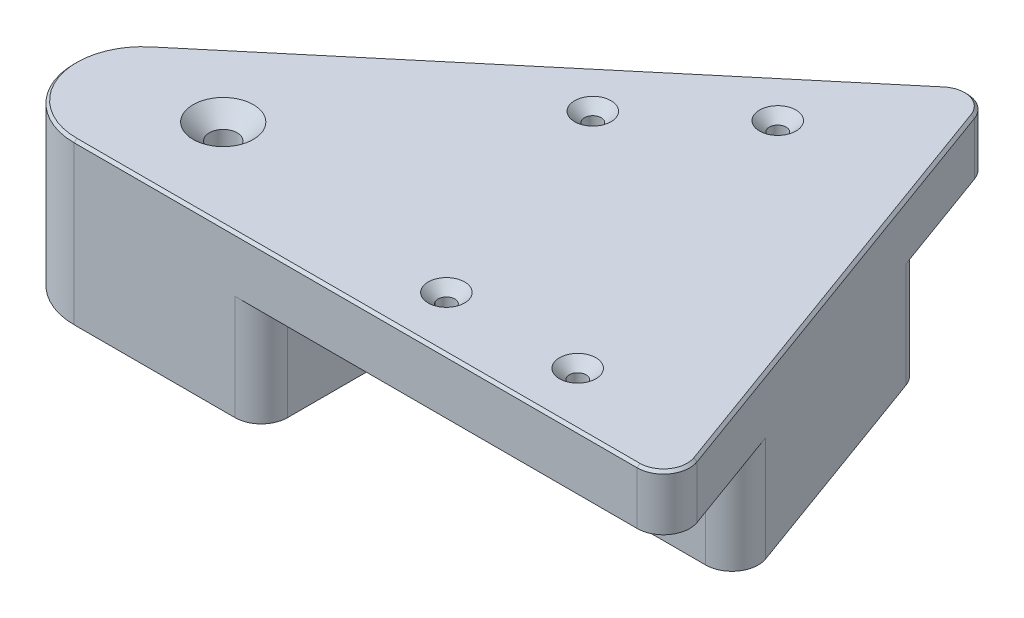
ISO-10303-21;
HEADER;
FILE_DESCRIPTION(('STEP AP214'),'2;1');
FILE_NAME('part.step','',(''),(''),'','','');
FILE_SCHEMA(('AUTOMOTIVE_DESIGN { 1 0 10303 214 1 1 1 1 }'));
ENDSEC;
DATA;
#1=APPLICATION_CONTEXT('core data for automotive mechanical design processes');
#2=APPLICATION_PROTOCOL_DEFINITION('international standard','automotive_design',2000,#1);
#3=PRODUCT_CONTEXT('',#1,'mechanical');
#4=PRODUCT('Part','Part','',(#3));
#5=PRODUCT_RELATED_PRODUCT_CATEGORY('part','',(#4));
#6=PRODUCT_DEFINITION_FORMATION('','',#4);
#7=PRODUCT_DEFINITION_CONTEXT('part definition',#1,'design');
#8=PRODUCT_DEFINITION('design','',#6,#7);
#9=PRODUCT_DEFINITION_SHAPE('','',#8);
#10=(LENGTH_UNIT() NAMED_UNIT(*) SI_UNIT(.MILLI.,.METRE.));
#11=(NAMED_UNIT(*) PLANE_ANGLE_UNIT() SI_UNIT($,.RADIAN.));
#12=(NAMED_UNIT(*) SI_UNIT($,.STERADIAN.) SOLID_ANGLE_UNIT());
#13=UNCERTAINTY_MEASURE_WITH_UNIT(LENGTH_MEASURE(1.E-05),#10,'distance_accuracy_value','');
#14=(GEOMETRIC_REPRESENTATION_CONTEXT(3) GLOBAL_UNCERTAINTY_ASSIGNED_CONTEXT((#13)) GLOBAL_UNIT_ASSIGNED_CONTEXT((#10,
#11,#12)) REPRESENTATION_CONTEXT('',''));
#15=CARTESIAN_POINT('',(0.,0.,0.));
#16=DIRECTION('',(0.,0.,1.));
#17=DIRECTION('',(1.,0.,0.));
#18=AXIS2_PLACEMENT_3D('',#15,#16,#17);
#19=CARTESIAN_POINT('',(0.,0.,0.));
#20=DIRECTION('',(0.,1.,0.));
#21=DIRECTION('',(0.,0.,1.));
#22=AXIS2_PLACEMENT_3D('',#19,#20,#21);
#23=PLANE('',#22);
#24=CARTESIAN_POINT('',(-28.0153689607046,0.,-17.1010071662835));
#25=DIRECTION('',(0.,1.,0.));
#26=DIRECTION('',(0.,0.,1.));
#27=AXIS2_PLACEMENT_3D('',#24,#25,#26);
#28=CIRCLE('',#27,2.65);
#29=CARTESIAN_POINT('',(-28.0153689607046,0.,-14.4510071662835));
#30=VERTEX_POINT('',#29);
#31=EDGE_CURVE('E296',#30,#30,#28,.T.);
#32=ORIENTED_EDGE('',*,*,#31,.T.);
#33=EDGE_LOOP('',(#32));
#34=FACE_BOUND('',#33,.T.);
#35=DIRECTION('',(-0.342020143325669,0.,-0.939692620785908));
#36=VECTOR('',#35,1.);
#37=CARTESIAN_POINT('',(-9.61018621461067,0.,3.49782172787368));
#38=LINE('',#37,#36);
#39=CARTESIAN_POINT('',(-14.8778131285609,0.,-10.974864272316));
#40=VERTEX_POINT('',#39);
#41=CARTESIAN_POINT('',(-21.8892260667371,0.,-30.2385629984272));
#42=VERTEX_POINT('',#41);
#43=EDGE_CURVE('E246',#40,#42,#38,.T.);
#44=ORIENTED_EDGE('',*,*,#43,.F.);
#45=DIRECTION('',(0.939692620785908,0.,-0.342020143325669));
#46=VECTOR('',#45,1.);
#47=CARTESIAN_POINT('',(-5.26762691395024,0.,-14.4726860001897));
#48=LINE('',#47,#46);
#49=CARTESIAN_POINT('',(-34.141511854672,0.,-3.96345133413981));
#50=VERTEX_POINT('',#49);
#51=EDGE_CURVE('E248',#50,#40,#48,.T.);
#52=ORIENTED_EDGE('',*,*,#51,.F.);
#53=DIRECTION('',(-0.342020143325669,0.,-0.939692620785909));
#54=VECTOR('',#53,1.);
#55=CARTESIAN_POINT('',(-28.8738849407218,0.,10.5092346660499));
#56=LINE('',#55,#54);
#57=CARTESIAN_POINT('',(-41.1529247928483,0.,-23.2271500602509));
#58=VERTEX_POINT('',#57);
#59=EDGE_CURVE('E251',#50,#58,#56,.T.);
#60=ORIENTED_EDGE('',*,*,#59,.T.);
#61=DIRECTION('',(0.939692620785908,0.,-0.34202014332567));
#62=VECTOR('',#61,1.);
#63=CARTESIAN_POINT('',(-12.2790398521265,0.,-33.7363847263008));
#64=LINE('',#63,#62);
#65=EDGE_CURVE('E254',#58,#42,#64,.T.);
#66=ORIENTED_EDGE('',*,*,#65,.T.);
#67=EDGE_LOOP('',(#44,#52,#60,#66));
#68=FACE_BOUND('',#67,.T.);
#69=ADVANCED_FACE('F45',(#34,#68),#23,.F.);
#70=CARTESIAN_POINT('',(24.5000344948225,0.,-70.1100175310766));
#71=DIRECTION('',(0.,1.,0.));
#72=DIRECTION('',(0.,0.,1.));
#73=AXIS2_PLACEMENT_3D('',#70,#71,#72);
#74=CIRCLE('',#73,1.6);
#75=CARTESIAN_POINT('',(24.5000344948225,0.,-68.5100175310766));
#76=VERTEX_POINT('',#75);
#77=EDGE_CURVE('E291',#76,#76,#74,.T.);
#78=ORIENTED_EDGE('',*,*,#77,.T.);
#79=EDGE_LOOP('',(#78));
#80=FACE_BOUND('',#79,.T.);
#81=CARTESIAN_POINT('',(5.3627076205699,0.,-54.0518936091721));
#82=DIRECTION('',(0.,1.,0.));
#83=DIRECTION('',(0.,0.,1.));
#84=AXIS2_PLACEMENT_3D('',#81,#82,#83);
#85=CIRCLE('',#84,1.6);
#86=CARTESIAN_POINT('',(5.3627076205699,0.,-52.4518936091721));
#87=VERTEX_POINT('',#86);
#88=EDGE_CURVE('E286',#87,#87,#85,.T.);
#89=ORIENTED_EDGE('',*,*,#88,.T.);
#90=EDGE_LOOP('',(#89));
#91=FACE_BOUND('',#90,.T.);
#92=DIRECTION('',(0.766044443118977,0.,-0.64278760968654));
#93=VECTOR('',#92,1.);
#94=CARTESIAN_POINT('',(-30.9881933374902,0.,-36.9302907379578));
#95=LINE('',#94,#93);
#96=CARTESIAN_POINT('',(-24.1934144685647,0.,-42.6317871808044));
#97=VERTEX_POINT('',#96);
#98=CARTESIAN_POINT('',(34.4365422452653,0.,-91.8281622353192));
#99=VERTEX_POINT('',#98);
#100=EDGE_CURVE('E271',#97,#99,#95,.T.);
#101=ORIENTED_EDGE('',*,*,#100,.T.);
#102=CARTESIAN_POINT('',(37.650480293698,0.,-87.9979400197244));
#103=DIRECTION('',(0.,1.,0.));
#104=DIRECTION('',(0.,0.,1.));
#105=AXIS2_PLACEMENT_3D('',#102,#103,#104);
#106=CIRCLE('',#105,5.);
#107=CARTESIAN_POINT('',(42.3489433976276,0.,-89.7080407363527));
#108=VERTEX_POINT('',#107);
#109=EDGE_CURVE('E343',#99,#108,#106,.F.);
#110=ORIENTED_EDGE('',*,*,#109,.T.);
#111=DIRECTION('',(0.34202014332567,0.,0.939692620785908));
#112=VECTOR('',#111,1.);
#113=CARTESIAN_POINT('',(66.2266666169616,0.,-24.1045353632453));
#114=LINE('',#113,#112);
#115=CARTESIAN_POINT('',(49.8103332000848,0.,-69.2080407363527));
#116=VERTEX_POINT('',#115);
#117=EDGE_CURVE('E269',#108,#116,#114,.T.);
#118=ORIENTED_EDGE('',*,*,#117,.T.);
#119=CARTESIAN_POINT('',(45.1118700961552,0.,-67.4979400197244));
#120=DIRECTION('',(0.,1.,0.));
#121=DIRECTION('',(0.,0.,1.));
#122=AXIS2_PLACEMENT_3D('',#119,#120,#121);
#123=CIRCLE('',#122,5.);
#124=CARTESIAN_POINT('',(41.8979320477225,0.,-71.3281622353193));
#125=VERTEX_POINT('',#124);
#126=EDGE_CURVE('E348',#116,#125,#123,.T.);
#127=ORIENTED_EDGE('',*,*,#126,.T.);
#128=DIRECTION('',(0.766044443118977,0.,-0.64278760968654));
#129=VECTOR('',#128,1.);
#130=CARTESIAN_POINT('',(-17.8110473389161,0.,-21.2263796540188));
#131=LINE('',#130,#129);
#132=CARTESIAN_POINT('',(-7.1860462543957,0.,-30.1418141452981));
#133=VERTEX_POINT('',#132);
#134=EDGE_CURVE('E257',#133,#125,#131,.T.);
#135=ORIENTED_EDGE('',*,*,#134,.F.);
#136=DIRECTION('',(-0.642787609686541,0.,-0.766044443118977));
#137=VECTOR('',#136,1.);
#138=CARTESIAN_POINT('',(10.6250010845204,0.,-8.91543449127932));
#139=LINE('',#138,#137);
#140=CARTESIAN_POINT('',(-17.1492542045371,0.,-42.0155030136423));
#141=VERTEX_POINT('',#140);
#142=EDGE_CURVE('E209',#133,#141,#139,.T.);
#143=ORIENTED_EDGE('',*,*,#142,.T.);
#144=CARTESIAN_POINT('',(-20.979476420132,0.,-38.8015649652095));
#145=DIRECTION('',(0.,1.,0.));
#146=DIRECTION('',(0.,0.,1.));
#147=AXIS2_PLACEMENT_3D('',#144,#145,#146);
#148=CIRCLE('',#147,5.);
#149=EDGE_CURVE('E316',#141,#97,#148,.T.);
#150=ORIENTED_EDGE('',*,*,#149,.T.);
#151=EDGE_LOOP('',(#101,#110,#118,#127,#135,#143,#150));
#152=FACE_BOUND('',#151,.T.);
#153=ADVANCED_FACE('F465',(#80,#91,#152),#23,.F.);
#154=CARTESIAN_POINT('',(46.2872990987875,0.,-10.25));
#155=DIRECTION('',(0.,1.,0.));
#156=DIRECTION('',(0.,0.,1.));
#157=AXIS2_PLACEMENT_3D('',#154,#155,#156);
#158=CIRCLE('',#157,1.59999999999999);
#159=CARTESIAN_POINT('',(46.2872990987875,0.,-8.65000000000001));
#160=VERTEX_POINT('',#159);
#161=EDGE_CURVE('E281',#160,#160,#158,.T.);
#162=ORIENTED_EDGE('',*,*,#161,.T.);
#163=EDGE_LOOP('',(#162));
#164=FACE_BOUND('',#163,.T.);
#165=CARTESIAN_POINT('',(21.3052930988036,0.,-10.25));
#166=DIRECTION('',(0.,1.,0.));
#167=DIRECTION('',(0.,0.,1.));
#168=AXIS2_PLACEMENT_3D('',#165,#166,#167);
#169=CIRCLE('',#168,1.6);
#170=CARTESIAN_POINT('',(21.3052930988036,0.,-8.65000000000001));
#171=VERTEX_POINT('',#170);
#172=EDGE_CURVE('E249',#171,#171,#169,.T.);
#173=ORIENTED_EDGE('',*,*,#172,.T.);
#174=EDGE_LOOP('',(#173));
#175=FACE_BOUND('',#174,.T.);
#176=CARTESIAN_POINT('',(65.0963332677618,0.,-27.2101007166284));
#177=VERTEX_POINT('',#176);
#178=CARTESIAN_POINT('',(72.557723070219,0.,-6.71010071662836));
#179=VERTEX_POINT('',#178);
#180=EDGE_CURVE('E267',#177,#179,#114,.T.);
#181=ORIENTED_EDGE('',*,*,#180,.T.);
#182=CARTESIAN_POINT('',(67.8592599662894,0.,-5.00000000000002));
#183=DIRECTION('',(0.,1.,0.));
#184=DIRECTION('',(0.,0.,1.));
#185=AXIS2_PLACEMENT_3D('',#182,#183,#184);
#186=CIRCLE('',#185,5.);
#187=CARTESIAN_POINT('',(67.8592599662894,0.,0.));
#188=VERTEX_POINT('',#187);
#189=EDGE_CURVE('E329',#179,#188,#186,.F.);
#190=ORIENTED_EDGE('',*,*,#189,.T.);
#191=DIRECTION('',(1.,0.,0.));
#192=VECTOR('',#191,1.);
#193=CARTESIAN_POINT('',(0.,0.,0.));
#194=LINE('',#193,#192);
#195=CARTESIAN_POINT('',(-8.67671290118036,0.,0.));
#196=VERTEX_POINT('',#195);
#197=EDGE_CURVE('E274',#196,#188,#194,.T.);
#198=ORIENTED_EDGE('',*,*,#197,.F.);
#199=CARTESIAN_POINT('',(-8.67671290118036,0.,-5.00000000000001));
#200=DIRECTION('',(0.,1.,0.));
#201=DIRECTION('',(0.,0.,1.));
#202=AXIS2_PLACEMENT_3D('',#199,#200,#201);
#203=CIRCLE('',#202,5.);
#204=CARTESIAN_POINT('',(-3.67671290118036,0.,-5.00000000000001));
#205=VERTEX_POINT('',#204);
#206=EDGE_CURVE('E314',#196,#205,#203,.T.);
#207=ORIENTED_EDGE('',*,*,#206,.T.);
#208=DIRECTION('',(0.,0.,1.));
#209=VECTOR('',#208,1.);
#210=CARTESIAN_POINT('',(-3.67671290118036,0.,0.));
#211=LINE('',#210,#209);
#212=CARTESIAN_POINT('',(-3.67671290118036,0.,-20.5));
#213=VERTEX_POINT('',#212);
#214=EDGE_CURVE('E260',#213,#205,#211,.T.);
#215=ORIENTED_EDGE('',*,*,#214,.F.);
#216=DIRECTION('',(1.,0.,0.));
#217=VECTOR('',#216,1.);
#218=CARTESIAN_POINT('',(0.,0.,-20.5));
#219=LINE('',#218,#217);
#220=CARTESIAN_POINT('',(60.3978701638323,0.,-20.5));
#221=VERTEX_POINT('',#220);
#222=EDGE_CURVE('E263',#213,#221,#219,.T.);
#223=ORIENTED_EDGE('',*,*,#222,.T.);
#224=CARTESIAN_POINT('',(60.3978701638323,0.,-25.5));
#225=DIRECTION('',(0.,1.,0.));
#226=DIRECTION('',(0.,0.,1.));
#227=AXIS2_PLACEMENT_3D('',#224,#225,#226);
#228=CIRCLE('',#227,5.);
#229=EDGE_CURVE('E345',#221,#177,#228,.T.);
#230=ORIENTED_EDGE('',*,*,#229,.T.);
#231=EDGE_LOOP('',(#181,#190,#198,#207,#215,#223,#230));
#232=FACE_BOUND('',#231,.T.);
#233=ADVANCED_FACE('F467',(#164,#175,#232),#23,.F.);
#234=CARTESIAN_POINT('',(66.2266666169616,10.5,-24.1045353632453));
#235=DIRECTION('',(0.939692620785908,0.,-0.34202014332567));
#236=DIRECTION('',(-0.34202014332567,0.,-0.939692620785908));
#237=AXIS2_PLACEMENT_3D('',#234,#235,#236);
#238=PLANE('',#237);
#239=DIRECTION('',(0.,-1.,0.));
#240=VECTOR('',#239,1.);
#241=CARTESIAN_POINT('',(42.3489433976276,10.5,-89.7080407363527));
#242=LINE('',#241,#240);
#243=CARTESIAN_POINT('',(42.3489433976276,10.,-89.7080407363527));
#244=VERTEX_POINT('',#243);
#245=EDGE_CURVE('E319',#108,#244,#242,.F.);
#246=ORIENTED_EDGE('',*,*,#245,.T.);
#247=DIRECTION('',(0.34202014332567,0.,0.939692620785908));
#248=VECTOR('',#247,1.);
#249=CARTESIAN_POINT('',(66.2266666169616,10.,-24.1045353632453));
#250=LINE('',#249,#248);
#251=CARTESIAN_POINT('',(72.557723070219,10.,-6.71010071662837));
#252=VERTEX_POINT('',#251);
#253=EDGE_CURVE('E356',#244,#252,#250,.T.);
#254=ORIENTED_EDGE('',*,*,#253,.T.);
#255=DIRECTION('',(0.,-1.,0.));
#256=VECTOR('',#255,1.);
#257=CARTESIAN_POINT('',(72.557723070219,0.,-6.71010071662837));
#258=LINE('',#257,#256);
#259=EDGE_CURVE('E327',#252,#179,#258,.T.);
#260=ORIENTED_EDGE('',*,*,#259,.T.);
#261=ORIENTED_EDGE('',*,*,#180,.F.);
#262=DIRECTION('',(0.,1.,0.));
#263=VECTOR('',#262,1.);
#264=CARTESIAN_POINT('',(65.0963332677618,10.5,-27.2101007166284));
#265=LINE('',#264,#263);
#266=CARTESIAN_POINT('',(65.0963332677618,-20.,-27.2101007166284));
#267=VERTEX_POINT('',#266);
#268=EDGE_CURVE('E325',#177,#267,#265,.F.);
#269=ORIENTED_EDGE('',*,*,#268,.T.);
#270=DIRECTION('',(0.34202014332567,0.,0.939692620785908));
#271=VECTOR('',#270,1.);
#272=CARTESIAN_POINT('',(66.2266666169616,-20.,-24.1045353632453));
#273=LINE('',#272,#271);
#274=CARTESIAN_POINT('',(49.8103332000848,-20.,-69.2080407363527));
#275=VERTEX_POINT('',#274);
#276=EDGE_CURVE('E242',#275,#267,#273,.T.);
#277=ORIENTED_EDGE('',*,*,#276,.F.);
#278=DIRECTION('',(0.,1.,0.));
#279=VECTOR('',#278,1.);
#280=CARTESIAN_POINT('',(49.8103332000848,0.,-69.2080407363527));
#281=LINE('',#280,#279);
#282=EDGE_CURVE('E322',#275,#116,#281,.T.);
#283=ORIENTED_EDGE('',*,*,#282,.T.);
#284=ORIENTED_EDGE('',*,*,#117,.F.);
#285=EDGE_LOOP('',(#246,#254,#260,#261,#269,#277,#283,#284));
#286=FACE_BOUND('',#285,.T.);
#287=ADVANCED_FACE('F474',(#286),#238,.T.);
#288=CARTESIAN_POINT('',(-30.9881933374902,10.5,-36.9302907379578));
#289=DIRECTION('',(-0.64278760968654,0.,-0.766044443118977));
#290=DIRECTION('',(-0.766044443118977,0.,0.64278760968654));
#291=AXIS2_PLACEMENT_3D('',#288,#289,#290);
#292=PLANE('',#291);
#293=DIRECTION('',(0.,-1.,0.));
#294=VECTOR('',#293,1.);
#295=CARTESIAN_POINT('',(-47.639032473015,10.5,-22.9585777605467));
#296=LINE('',#295,#294);
#297=CARTESIAN_POINT('',(-47.639032473015,-20.,-22.9585777605467));
#298=VERTEX_POINT('',#297);
#299=CARTESIAN_POINT('',(-47.639032473015,10.,-22.9585777605467));
#300=VERTEX_POINT('',#299);
#301=EDGE_CURVE('E354',#298,#300,#296,.F.);
#302=ORIENTED_EDGE('',*,*,#301,.T.);
#303=DIRECTION('',(0.766044443118977,0.,-0.64278760968654));
#304=VECTOR('',#303,1.);
#305=CARTESIAN_POINT('',(-30.9881933374902,10.,-36.9302907379578));
#306=LINE('',#305,#304);
#307=CARTESIAN_POINT('',(34.4365422452653,10.,-91.8281622353192));
#308=VERTEX_POINT('',#307);
#309=EDGE_CURVE('E392',#300,#308,#306,.T.);
#310=ORIENTED_EDGE('',*,*,#309,.T.);
#311=DIRECTION('',(0.,-1.,0.));
#312=VECTOR('',#311,1.);
#313=CARTESIAN_POINT('',(34.4365422452653,10.5,-91.8281622353192));
#314=LINE('',#313,#312);
#315=EDGE_CURVE('E341',#308,#99,#314,.T.);
#316=ORIENTED_EDGE('',*,*,#315,.T.);
#317=ORIENTED_EDGE('',*,*,#100,.F.);
#318=DIRECTION('',(0.,1.,0.));
#319=VECTOR('',#318,1.);
#320=CARTESIAN_POINT('',(-24.1934144685647,10.5,-42.6317871808044));
#321=LINE('',#320,#319);
#322=CARTESIAN_POINT('',(-24.1934144685647,-20.,-42.6317871808044));
#323=VERTEX_POINT('',#322);
#324=EDGE_CURVE('E311',#97,#323,#321,.F.);
#325=ORIENTED_EDGE('',*,*,#324,.T.);
#326=DIRECTION('',(0.766044443118977,0.,-0.64278760968654));
#327=VECTOR('',#326,1.);
#328=CARTESIAN_POINT('',(-30.9881933374902,-20.,-36.9302907379578));
#329=LINE('',#328,#327);
#330=EDGE_CURVE('E229',#298,#323,#329,.T.);
#331=ORIENTED_EDGE('',*,*,#330,.F.);
#332=EDGE_LOOP('',(#302,#310,#316,#317,#325,#331));
#333=FACE_BOUND('',#332,.T.);
#334=ADVANCED_FACE('F460',(#333),#292,.T.);
#335=CARTESIAN_POINT('',(0.,10.5,0.));
#336=DIRECTION('',(0.,0.,-1.));
#337=DIRECTION('',(-1.,0.,0.));
#338=AXIS2_PLACEMENT_3D('',#335,#336,#337);
#339=PLANE('',#338);
#340=DIRECTION('',(0.,-1.,0.));
#341=VECTOR('',#340,1.);
#342=CARTESIAN_POINT('',(67.8592599662894,10.5,0.));
#343=LINE('',#342,#341);
#344=CARTESIAN_POINT('',(67.8592599662894,10.,0.));
#345=VERTEX_POINT('',#344);
#346=EDGE_CURVE('E331',#188,#345,#343,.F.);
#347=ORIENTED_EDGE('',*,*,#346,.T.);
#348=DIRECTION('',(-1.,0.,0.));
#349=VECTOR('',#348,1.);
#350=CARTESIAN_POINT('',(-39.28279354709,10.,0.));
#351=LINE('',#350,#349);
#352=CARTESIAN_POINT('',(-39.28279354709,10.,0.));
#353=VERTEX_POINT('',#352);
#354=EDGE_CURVE('E54',#345,#353,#351,.T.);
#355=ORIENTED_EDGE('',*,*,#354,.T.);
#356=DIRECTION('',(0.,-1.,0.));
#357=VECTOR('',#356,1.);
#358=CARTESIAN_POINT('',(-39.28279354709,-20.,0.));
#359=LINE('',#358,#357);
#360=CARTESIAN_POINT('',(-39.28279354709,-20.,0.));
#361=VERTEX_POINT('',#360);
#362=EDGE_CURVE('E350',#353,#361,#359,.T.);
#363=ORIENTED_EDGE('',*,*,#362,.T.);
#364=DIRECTION('',(1.,0.,0.));
#365=VECTOR('',#364,1.);
#366=CARTESIAN_POINT('',(0.,-20.,0.));
#367=LINE('',#366,#365);
#368=CARTESIAN_POINT('',(-8.67671290118036,-20.,0.));
#369=VERTEX_POINT('',#368);
#370=EDGE_CURVE('E231',#361,#369,#367,.T.);
#371=ORIENTED_EDGE('',*,*,#370,.T.);
#372=DIRECTION('',(0.,1.,0.));
#373=VECTOR('',#372,1.);
#374=CARTESIAN_POINT('',(-8.67671290118036,10.5,0.));
#375=LINE('',#374,#373);
#376=EDGE_CURVE('E277',#369,#196,#375,.T.);
#377=ORIENTED_EDGE('',*,*,#376,.T.);
#378=ORIENTED_EDGE('',*,*,#197,.T.);
#379=EDGE_LOOP('',(#347,#355,#363,#371,#377,#378));
#380=FACE_BOUND('',#379,.T.);
#381=ADVANCED_FACE('F450',(#380),#339,.F.);
#382=CARTESIAN_POINT('',(0.,10.5,0.));
#383=DIRECTION('',(0.,1.,0.));
#384=DIRECTION('',(0.,0.,1.));
#385=AXIS2_PLACEMENT_3D('',#382,#383,#384);
#386=PLANE('',#385);
#387=CARTESIAN_POINT('',(67.8592599662894,10.5,-5.00000000000002));
#388=DIRECTION('',(0.,1.,0.));
#389=DIRECTION('',(0.,0.,1.));
#390=AXIS2_PLACEMENT_3D('',#387,#388,#389);
#391=CIRCLE('',#390,4.50000000000001);
#392=CARTESIAN_POINT('',(67.8592599662894,10.5,-0.500000000000015));
#393=VERTEX_POINT('',#392);
#394=CARTESIAN_POINT('',(72.087876759826,10.5,-6.53909064496554));
#395=VERTEX_POINT('',#394);
#396=EDGE_CURVE('E381',#393,#395,#391,.T.);
#397=ORIENTED_EDGE('',*,*,#396,.T.);
#398=DIRECTION('',(-0.34202014332567,0.,-0.939692620785908));
#399=VECTOR('',#398,1.);
#400=CARTESIAN_POINT('',(65.7568203065687,10.5,-23.9335252915824));
#401=LINE('',#400,#399);
#402=CARTESIAN_POINT('',(41.8790970872346,10.5,-89.5370306646899));
#403=VERTEX_POINT('',#402);
#404=EDGE_CURVE('E385',#395,#403,#401,.T.);
#405=ORIENTED_EDGE('',*,*,#404,.T.);
#406=CARTESIAN_POINT('',(37.650480293698,10.5,-87.9979400197244));
#407=DIRECTION('',(0.,1.,0.));
#408=DIRECTION('',(0.,0.,1.));
#409=AXIS2_PLACEMENT_3D('',#406,#407,#408);
#410=CIRCLE('',#409,4.50000000000002);
#411=CARTESIAN_POINT('',(34.7579360501086,10.5,-91.4451400137598));
#412=VERTEX_POINT('',#411);
#413=EDGE_CURVE('E383',#403,#412,#410,.T.);
#414=ORIENTED_EDGE('',*,*,#413,.T.);
#415=DIRECTION('',(-0.766044443118977,0.,0.64278760968654));
#416=VECTOR('',#415,1.);
#417=CARTESIAN_POINT('',(-30.666799532647,10.5,-36.5472685163983));
#418=LINE('',#417,#416);
#419=CARTESIAN_POINT('',(-47.3176386681717,10.5,-22.5755555389872));
#420=VERTEX_POINT('',#419);
#421=EDGE_CURVE('E379',#412,#420,#418,.T.);
#422=ORIENTED_EDGE('',*,*,#421,.T.);
#423=CARTESIAN_POINT('',(-39.28279354709,10.5,-13.));
#424=DIRECTION('',(0.,1.,0.));
#425=DIRECTION('',(0.,0.,1.));
#426=AXIS2_PLACEMENT_3D('',#423,#424,#425);
#427=CIRCLE('',#426,12.5);
#428=CARTESIAN_POINT('',(-39.28279354709,10.5,-0.499999999999995));
#429=VERTEX_POINT('',#428);
#430=EDGE_CURVE('E375',#420,#429,#427,.T.);
#431=ORIENTED_EDGE('',*,*,#430,.T.);
#432=DIRECTION('',(1.,0.,0.));
#433=VECTOR('',#432,1.);
#434=CARTESIAN_POINT('',(67.8592599662894,10.5,-0.500000000000015));
#435=LINE('',#434,#433);
#436=EDGE_CURVE('E377',#429,#393,#435,.T.);
#437=ORIENTED_EDGE('',*,*,#436,.T.);
#438=EDGE_LOOP('',(#397,#405,#414,#422,#431,#437));
#439=FACE_BOUND('',#438,.T.);
#440=CARTESIAN_POINT('',(-28.0153689607046,10.5,-17.1010071662835));
#441=DIRECTION('',(0.,1.,0.));
#442=DIRECTION('',(0.,0.,1.));
#443=AXIS2_PLACEMENT_3D('',#440,#441,#442);
#444=CIRCLE('',#443,5.735);
#445=CARTESIAN_POINT('',(-28.0153689607046,10.5,-11.3660071662835));
#446=VERTEX_POINT('',#445);
#447=EDGE_CURVE('E410',#446,#446,#444,.T.);
#448=ORIENTED_EDGE('',*,*,#447,.F.);
#449=EDGE_LOOP('',(#448));
#450=FACE_BOUND('',#449,.T.);
#451=CARTESIAN_POINT('',(24.5000344948225,10.5,-70.1100175310766));
#452=DIRECTION('',(0.,1.,0.));
#453=DIRECTION('',(0.,0.,1.));
#454=AXIS2_PLACEMENT_3D('',#451,#452,#453);
#455=CIRCLE('',#454,3.47);
#456=CARTESIAN_POINT('',(24.5000344948225,10.5,-66.6400175310766));
#457=VERTEX_POINT('',#456);
#458=EDGE_CURVE('E299',#457,#457,#455,.T.);
#459=ORIENTED_EDGE('',*,*,#458,.F.);
#460=EDGE_LOOP('',(#459));
#461=FACE_BOUND('',#460,.T.);
#462=CARTESIAN_POINT('',(5.3627076205699,10.5,-54.0518936091721));
#463=DIRECTION('',(0.,1.,0.));
#464=DIRECTION('',(0.,0.,1.));
#465=AXIS2_PLACEMENT_3D('',#462,#463,#464);
#466=CIRCLE('',#465,3.47);
#467=CARTESIAN_POINT('',(5.3627076205699,10.5,-50.5818936091721));
#468=VERTEX_POINT('',#467);
#469=EDGE_CURVE('E294',#468,#468,#466,.T.);
#470=ORIENTED_EDGE('',*,*,#469,.F.);
#471=EDGE_LOOP('',(#470));
#472=FACE_BOUND('',#471,.T.);
#473=CARTESIAN_POINT('',(46.2872990987875,10.5,-10.25));
#474=DIRECTION('',(0.,1.,0.));
#475=DIRECTION('',(0.,0.,1.));
#476=AXIS2_PLACEMENT_3D('',#473,#474,#475);
#477=CIRCLE('',#476,3.47);
#478=CARTESIAN_POINT('',(46.2872990987875,10.5,-6.78));
#479=VERTEX_POINT('',#478);
#480=EDGE_CURVE('E289',#479,#479,#477,.T.);
#481=ORIENTED_EDGE('',*,*,#480,.F.);
#482=EDGE_LOOP('',(#481));
#483=FACE_BOUND('',#482,.T.);
#484=CARTESIAN_POINT('',(21.3052930988036,10.5,-10.25));
#485=DIRECTION('',(0.,1.,0.));
#486=DIRECTION('',(0.,0.,1.));
#487=AXIS2_PLACEMENT_3D('',#484,#485,#486);
#488=CIRCLE('',#487,3.47);
#489=CARTESIAN_POINT('',(21.3052930988036,10.5,-6.78));
#490=VERTEX_POINT('',#489);
#491=EDGE_CURVE('E284',#490,#490,#488,.T.);
#492=ORIENTED_EDGE('',*,*,#491,.F.);
#493=EDGE_LOOP('',(#492));
#494=FACE_BOUND('',#493,.T.);
#495=ADVANCED_FACE('F448',(#439,#450,#461,#472,#483,#494),#386,.T.);
#496=CARTESIAN_POINT('',(-17.8110473389161,-20.,-21.2263796540188));
#497=DIRECTION('',(0.64278760968654,0.,0.766044443118977));
#498=DIRECTION('',(0.766044443118977,0.,-0.64278760968654));
#499=AXIS2_PLACEMENT_3D('',#496,#497,#498);
#500=PLANE('',#499);
#501=ORIENTED_EDGE('',*,*,#134,.T.);
#502=DIRECTION('',(0.,1.,0.));
#503=VECTOR('',#502,1.);
#504=CARTESIAN_POINT('',(41.8979320477225,-20.,-71.3281622353193));
#505=LINE('',#504,#503);
#506=CARTESIAN_POINT('',(41.8979320477225,-20.,-71.3281622353193));
#507=VERTEX_POINT('',#506);
#508=EDGE_CURVE('E220',#125,#507,#505,.F.);
#509=ORIENTED_EDGE('',*,*,#508,.T.);
#510=DIRECTION('',(0.766044443118977,0.,-0.64278760968654));
#511=VECTOR('',#510,1.);
#512=CARTESIAN_POINT('',(-17.8110473389161,-20.,-21.2263796540188));
#513=LINE('',#512,#511);
#514=CARTESIAN_POINT('',(-7.1860462543957,-20.,-30.1418141452981));
#515=VERTEX_POINT('',#514);
#516=EDGE_CURVE('E217',#515,#507,#513,.T.);
#517=ORIENTED_EDGE('',*,*,#516,.F.);
#518=DIRECTION('',(0.,1.,0.));
#519=VECTOR('',#518,1.);
#520=CARTESIAN_POINT('',(-7.1860462543957,-20.,-30.1418141452981));
#521=LINE('',#520,#519);
#522=EDGE_CURVE('E201',#515,#133,#521,.T.);
#523=ORIENTED_EDGE('',*,*,#522,.T.);
#524=EDGE_LOOP('',(#501,#509,#517,#523));
#525=FACE_BOUND('',#524,.T.);
#526=ADVANCED_FACE('F218',(#525),#500,.F.);
#527=CARTESIAN_POINT('',(0.,-20.,-20.5));
#528=DIRECTION('',(0.,0.,1.));
#529=DIRECTION('',(1.,0.,0.));
#530=AXIS2_PLACEMENT_3D('',#527,#528,#529);
#531=PLANE('',#530);
#532=DIRECTION('',(1.,0.,0.));
#533=VECTOR('',#532,1.);
#534=CARTESIAN_POINT('',(0.,-20.,-20.5));
#535=LINE('',#534,#533);
#536=CARTESIAN_POINT('',(-3.67671290118036,-20.,-20.5));
#537=VERTEX_POINT('',#536);
#538=CARTESIAN_POINT('',(60.3978701638323,-20.,-20.5));
#539=VERTEX_POINT('',#538);
#540=EDGE_CURVE('E239',#537,#539,#535,.T.);
#541=ORIENTED_EDGE('',*,*,#540,.T.);
#542=DIRECTION('',(0.,1.,0.));
#543=VECTOR('',#542,1.);
#544=CARTESIAN_POINT('',(60.3978701638323,-20.,-20.5));
#545=LINE('',#544,#543);
#546=EDGE_CURVE('E333',#539,#221,#545,.T.);
#547=ORIENTED_EDGE('',*,*,#546,.T.);
#548=ORIENTED_EDGE('',*,*,#222,.F.);
#549=DIRECTION('',(0.,1.,0.));
#550=VECTOR('',#549,1.);
#551=CARTESIAN_POINT('',(-3.67671290118036,-20.,-20.5));
#552=LINE('',#551,#550);
#553=EDGE_CURVE('E213',#537,#213,#552,.T.);
#554=ORIENTED_EDGE('',*,*,#553,.F.);
#555=EDGE_LOOP('',(#541,#547,#548,#554));
#556=FACE_BOUND('',#555,.T.);
#557=ADVANCED_FACE('F458',(#556),#531,.T.);
#558=CARTESIAN_POINT('',(-3.67671290118036,-20.,0.));
#559=DIRECTION('',(-1.,0.,0.));
#560=DIRECTION('',(0.,0.,1.));
#561=AXIS2_PLACEMENT_3D('',#558,#559,#560);
#562=PLANE('',#561);
#563=ORIENTED_EDGE('',*,*,#214,.T.);
#564=DIRECTION('',(0.,1.,0.));
#565=VECTOR('',#564,1.);
#566=CARTESIAN_POINT('',(-3.67671290118036,-20.,-5.00000000000001));
#567=LINE('',#566,#565);
#568=CARTESIAN_POINT('',(-3.67671290118036,-20.,-5.00000000000001));
#569=VERTEX_POINT('',#568);
#570=EDGE_CURVE('E303',#205,#569,#567,.F.);
#571=ORIENTED_EDGE('',*,*,#570,.T.);
#572=DIRECTION('',(0.,0.,1.));
#573=VECTOR('',#572,1.);
#574=CARTESIAN_POINT('',(-3.67671290118036,-20.,0.));
#575=LINE('',#574,#573);
#576=EDGE_CURVE('E236',#537,#569,#575,.T.);
#577=ORIENTED_EDGE('',*,*,#576,.F.);
#578=ORIENTED_EDGE('',*,*,#553,.T.);
#579=EDGE_LOOP('',(#563,#571,#577,#578));
#580=FACE_BOUND('',#579,.T.);
#581=ADVANCED_FACE('F535',(#580),#562,.F.);
#582=CARTESIAN_POINT('',(-9.61018621461067,0.,3.49782172787368));
#583=DIRECTION('',(-0.939656840170288,-0.00872653549837395,0.34200712024662));
#584=DIRECTION('',(0.342020143325669,0.,0.939692620785908));
#585=AXIS2_PLACEMENT_3D('',#582,#583,#584);
#586=PLANE('',#585);
#587=ORIENTED_EDGE('',*,*,#43,.T.);
#588=DIRECTION('',(0.00521541151162972,-0.99992385047757,-0.0111844860799952));
#589=VECTOR('',#588,1.);
#590=CARTESIAN_POINT('',(-21.8887606308226,-0.0892356184710689,-30.2395611289669));
#591=LINE('',#590,#589);
#592=CARTESIAN_POINT('',(-21.7849098928777,-20.,-30.4622697551897));
#593=VERTEX_POINT('',#592);
#594=EDGE_CURVE('E214',#593,#42,#591,.F.);
#595=ORIENTED_EDGE('',*,*,#594,.F.);
#596=DIRECTION('',(0.342020143325669,0.,0.939692620785908));
#597=VECTOR('',#596,1.);
#598=CARTESIAN_POINT('',(-9.44617474929966,-20.,3.43812643642209));
#599=LINE('',#598,#597);
#600=CARTESIAN_POINT('',(-14.6541063717983,-20.,-10.8705480984566));
#601=VERTEX_POINT('',#600);
#602=EDGE_CURVE('E266',#601,#593,#599,.F.);
#603=ORIENTED_EDGE('',*,*,#602,.F.);
#604=DIRECTION('',(-0.0111844860799952,0.999923850477571,-0.00521541151162973));
#605=VECTOR('',#604,1.);
#606=CARTESIAN_POINT('',(-14.8768149980211,-0.089235618471069,-10.9743988364015));
#607=LINE('',#606,#605);
#608=EDGE_CURVE('E245',#601,#40,#607,.T.);
#609=ORIENTED_EDGE('',*,*,#608,.T.);
#610=EDGE_LOOP('',(#587,#595,#603,#609));
#611=FACE_BOUND('',#610,.T.);
#612=ADVANCED_FACE('F562',(#611),#586,.T.);
#613=CARTESIAN_POINT('',(-12.2790398521265,0.,-33.7363847263008));
#614=DIRECTION('',(0.34200712024662,-0.00872653549837395,0.939656840170288));
#615=DIRECTION('',(0.939692620785908,0.,-0.34202014332567));
#616=AXIS2_PLACEMENT_3D('',#613,#614,#615);
#617=PLANE('',#616);
#618=ORIENTED_EDGE('',*,*,#65,.F.);
#619=DIRECTION('',(0.0111844860799952,0.99992385047757,0.00521541151162973));
#620=VECTOR('',#619,1.);
#621=CARTESIAN_POINT('',(-41.1499259012848,0.268109162799628,-23.2257516541489));
#622=LINE('',#621,#620);
#623=CARTESIAN_POINT('',(-41.3766315496109,-20.,-23.3314662341103));
#624=VERTEX_POINT('',#623);
#625=EDGE_CURVE('E357',#624,#58,#622,.T.);
#626=ORIENTED_EDGE('',*,*,#625,.F.);
#627=DIRECTION('',(0.939692620785908,0.,-0.34202014332567));
#628=VECTOR('',#627,1.);
#629=CARTESIAN_POINT('',(-12.3387351435781,-20.,-33.9003961916118));
#630=LINE('',#629,#628);
#631=EDGE_CURVE('E223',#624,#593,#630,.T.);
#632=ORIENTED_EDGE('',*,*,#631,.T.);
#633=ORIENTED_EDGE('',*,*,#594,.T.);
#634=EDGE_LOOP('',(#618,#626,#632,#633));
#635=FACE_BOUND('',#634,.T.);
#636=ADVANCED_FACE('F558',(#635),#617,.T.);
#637=CARTESIAN_POINT('',(-28.8738849407218,0.,10.5092346660499));
#638=DIRECTION('',(0.939656840170288,-0.00872653549837395,-0.342007120246619));
#639=DIRECTION('',(-0.342020143325669,0.,-0.939692620785908));
#640=AXIS2_PLACEMENT_3D('',#637,#638,#639);
#641=PLANE('',#640);
#642=ORIENTED_EDGE('',*,*,#59,.F.);
#643=DIRECTION('',(-0.00521541151162973,-0.999923850477571,0.0111844860799952));
#644=VECTOR('',#643,1.);
#645=CARTESIAN_POINT('',(-34.14011344857,0.268109162799628,-3.96645022570321));
#646=LINE('',#645,#644);
#647=CARTESIAN_POINT('',(-34.2458280285315,-20.,-3.73974457737721));
#648=VERTEX_POINT('',#647);
#649=EDGE_CURVE('E359',#648,#50,#646,.F.);
#650=ORIENTED_EDGE('',*,*,#649,.F.);
#651=DIRECTION('',(-0.342020143325669,0.,-0.939692620785908));
#652=VECTOR('',#651,1.);
#653=CARTESIAN_POINT('',(-29.0378964060328,-20.,10.5689299575015));
#654=LINE('',#653,#652);
#655=EDGE_CURVE('E367',#648,#624,#654,.T.);
#656=ORIENTED_EDGE('',*,*,#655,.T.);
#657=ORIENTED_EDGE('',*,*,#625,.T.);
#658=EDGE_LOOP('',(#642,#650,#656,#657));
#659=FACE_BOUND('',#658,.T.);
#660=ADVANCED_FACE('F561',(#659),#641,.T.);
#661=CARTESIAN_POINT('',(-5.26762691395024,0.,-14.4726860001897));
#662=DIRECTION('',(-0.34200712024662,-0.00872653549837395,-0.939656840170288));
#663=DIRECTION('',(-0.939692620785908,0.,0.342020143325669));
#664=AXIS2_PLACEMENT_3D('',#661,#662,#663);
#665=PLANE('',#664);
#666=ORIENTED_EDGE('',*,*,#51,.T.);
#667=ORIENTED_EDGE('',*,*,#608,.F.);
#668=DIRECTION('',(-0.939692620785908,0.,0.342020143325669));
#669=VECTOR('',#668,1.);
#670=CARTESIAN_POINT('',(-5.20793162249865,-20.,-14.3086745348787));
#671=LINE('',#670,#669);
#672=EDGE_CURVE('E370',#648,#601,#671,.F.);
#673=ORIENTED_EDGE('',*,*,#672,.F.);
#674=ORIENTED_EDGE('',*,*,#649,.T.);
#675=EDGE_LOOP('',(#666,#667,#673,#674));
#676=FACE_BOUND('',#675,.T.);
#677=ADVANCED_FACE('F569',(#676),#665,.T.);
#678=CARTESIAN_POINT('',(10.6250010845204,-20.,-8.91543449127932));
#679=DIRECTION('',(0.766044443118977,0.,-0.642787609686541));
#680=DIRECTION('',(-0.642787609686541,0.,-0.766044443118977));
#681=AXIS2_PLACEMENT_3D('',#678,#679,#680);
#682=PLANE('',#681);
#683=DIRECTION('',(-0.642787609686541,0.,-0.766044443118977));
#684=VECTOR('',#683,1.);
#685=CARTESIAN_POINT('',(10.6250010845204,-20.,-8.91543449127932));
#686=LINE('',#685,#684);
#687=CARTESIAN_POINT('',(-17.1492542045371,-20.,-42.0155030136423));
#688=VERTEX_POINT('',#687);
#689=EDGE_CURVE('E206',#515,#688,#686,.T.);
#690=ORIENTED_EDGE('',*,*,#689,.T.);
#691=DIRECTION('',(0.,1.,0.));
#692=VECTOR('',#691,1.);
#693=CARTESIAN_POINT('',(-17.1492542045371,-20.,-42.0155030136423));
#694=LINE('',#693,#692);
#695=EDGE_CURVE('E309',#688,#141,#694,.T.);
#696=ORIENTED_EDGE('',*,*,#695,.T.);
#697=ORIENTED_EDGE('',*,*,#142,.F.);
#698=ORIENTED_EDGE('',*,*,#522,.F.);
#699=EDGE_LOOP('',(#690,#696,#697,#698));
#700=FACE_BOUND('',#699,.T.);
#701=ADVANCED_FACE('F203',(#700),#682,.T.);
#702=CARTESIAN_POINT('',(0.,-20.,0.));
#703=DIRECTION('',(0.,1.,0.));
#704=DIRECTION('',(0.,0.,1.));
#705=AXIS2_PLACEMENT_3D('',#702,#703,#704);
#706=PLANE('',#705);
#707=ORIENTED_EDGE('',*,*,#602,.T.);
#708=ORIENTED_EDGE('',*,*,#631,.F.);
#709=ORIENTED_EDGE('',*,*,#655,.F.);
#710=ORIENTED_EDGE('',*,*,#672,.T.);
#711=EDGE_LOOP('',(#707,#708,#709,#710));
#712=FACE_BOUND('',#711,.T.);
#713=ORIENTED_EDGE('',*,*,#370,.F.);
#714=CARTESIAN_POINT('',(-39.28279354709,-20.,-13.));
#715=DIRECTION('',(0.,1.,0.));
#716=DIRECTION('',(0.,0.,1.));
#717=AXIS2_PLACEMENT_3D('',#714,#715,#716);
#718=CIRCLE('',#717,13.);
#719=EDGE_CURVE('E352',#361,#298,#718,.F.);
#720=ORIENTED_EDGE('',*,*,#719,.T.);
#721=ORIENTED_EDGE('',*,*,#330,.T.);
#722=CARTESIAN_POINT('',(-20.979476420132,-20.,-38.8015649652095));
#723=DIRECTION('',(0.,1.,0.));
#724=DIRECTION('',(0.,0.,1.));
#725=AXIS2_PLACEMENT_3D('',#722,#723,#724);
#726=CIRCLE('',#725,5.);
#727=EDGE_CURVE('E228',#323,#688,#726,.F.);
#728=ORIENTED_EDGE('',*,*,#727,.T.);
#729=ORIENTED_EDGE('',*,*,#689,.F.);
#730=ORIENTED_EDGE('',*,*,#516,.T.);
#731=CARTESIAN_POINT('',(45.1118700961552,-20.,-67.4979400197244));
#732=DIRECTION('',(0.,1.,0.));
#733=DIRECTION('',(0.,0.,1.));
#734=AXIS2_PLACEMENT_3D('',#731,#732,#733);
#735=CIRCLE('',#734,5.);
#736=EDGE_CURVE('E336',#507,#275,#735,.F.);
#737=ORIENTED_EDGE('',*,*,#736,.T.);
#738=ORIENTED_EDGE('',*,*,#276,.T.);
#739=CARTESIAN_POINT('',(60.3978701638323,-20.,-25.5));
#740=DIRECTION('',(0.,1.,0.));
#741=DIRECTION('',(0.,0.,1.));
#742=AXIS2_PLACEMENT_3D('',#739,#740,#741);
#743=CIRCLE('',#742,5.);
#744=EDGE_CURVE('E338',#267,#539,#743,.F.);
#745=ORIENTED_EDGE('',*,*,#744,.T.);
#746=ORIENTED_EDGE('',*,*,#540,.F.);
#747=ORIENTED_EDGE('',*,*,#576,.T.);
#748=CARTESIAN_POINT('',(-8.67671290118036,-20.,-5.00000000000001));
#749=DIRECTION('',(0.,1.,0.));
#750=DIRECTION('',(0.,0.,1.));
#751=AXIS2_PLACEMENT_3D('',#748,#749,#750);
#752=CIRCLE('',#751,5.);
#753=EDGE_CURVE('E306',#569,#369,#752,.F.);
#754=ORIENTED_EDGE('',*,*,#753,.T.);
#755=EDGE_LOOP('',(#713,#720,#721,#728,#729,#730,#737,#738,#745,#746,#747,#754));
#756=FACE_BOUND('',#755,.T.);
#757=ADVANCED_FACE('F226',(#712,#756),#706,.F.);
#758=CARTESIAN_POINT('',(21.3052930988036,10.5,-10.25));
#759=DIRECTION('',(0.,1.,0.));
#760=DIRECTION('',(0.,0.,1.));
#761=AXIS2_PLACEMENT_3D('',#758,#759,#760);
#762=CYLINDRICAL_SURFACE('',#761,1.6);
#763=CARTESIAN_POINT('',(21.3052930988036,8.63,-10.25));
#764=DIRECTION('',(0.,1.,0.));
#765=DIRECTION('',(0.,0.,1.));
#766=AXIS2_PLACEMENT_3D('',#763,#764,#765);
#767=CIRCLE('',#766,1.6);
#768=CARTESIAN_POINT('',(21.3052930988036,8.63,-8.65));
#769=VERTEX_POINT('',#768);
#770=EDGE_CURVE('E280',#769,#769,#767,.T.);
#771=ORIENTED_EDGE('',*,*,#770,.T.);
#772=EDGE_LOOP('',(#771));
#773=FACE_BOUND('',#772,.T.);
#774=ORIENTED_EDGE('',*,*,#172,.F.);
#775=EDGE_LOOP('',(#774));
#776=FACE_BOUND('',#775,.T.);
#777=ADVANCED_FACE('F438',(#773,#776),#762,.F.);
#778=CARTESIAN_POINT('',(21.3052930988036,10.5,-10.25));
#779=DIRECTION('',(0.,1.,0.));
#780=DIRECTION('',(0.,0.,1.));
#781=AXIS2_PLACEMENT_3D('',#778,#779,#780);
#782=CONICAL_SURFACE('',#781,3.47,0.785398163397448);
#783=ORIENTED_EDGE('',*,*,#770,.F.);
#784=EDGE_LOOP('',(#783));
#785=FACE_BOUND('',#784,.T.);
#786=ORIENTED_EDGE('',*,*,#491,.T.);
#787=EDGE_LOOP('',(#786));
#788=FACE_BOUND('',#787,.T.);
#789=ADVANCED_FACE('F441',(#785,#788),#782,.F.);
#790=CARTESIAN_POINT('',(46.2872990987875,10.5,-10.25));
#791=DIRECTION('',(0.,1.,0.));
#792=DIRECTION('',(0.,0.,1.));
#793=AXIS2_PLACEMENT_3D('',#790,#791,#792);
#794=CYLINDRICAL_SURFACE('',#793,1.59999999999999);
#795=CARTESIAN_POINT('',(46.2872990987875,8.63,-10.25));
#796=DIRECTION('',(0.,1.,0.));
#797=DIRECTION('',(0.,0.,1.));
#798=AXIS2_PLACEMENT_3D('',#795,#796,#797);
#799=CIRCLE('',#798,1.6);
#800=CARTESIAN_POINT('',(46.2872990987875,8.63,-8.65));
#801=VERTEX_POINT('',#800);
#802=EDGE_CURVE('E285',#801,#801,#799,.T.);
#803=ORIENTED_EDGE('',*,*,#802,.T.);
#804=EDGE_LOOP('',(#803));
#805=FACE_BOUND('',#804,.T.);
#806=ORIENTED_EDGE('',*,*,#161,.F.);
#807=EDGE_LOOP('',(#806));
#808=FACE_BOUND('',#807,.T.);
#809=ADVANCED_FACE('F444',(#805,#808),#794,.F.);
#810=CARTESIAN_POINT('',(46.2872990987875,10.5,-10.25));
#811=DIRECTION('',(0.,1.,0.));
#812=DIRECTION('',(0.,0.,1.));
#813=AXIS2_PLACEMENT_3D('',#810,#811,#812);
#814=CONICAL_SURFACE('',#813,3.47,0.785398163397448);
#815=ORIENTED_EDGE('',*,*,#802,.F.);
#816=EDGE_LOOP('',(#815));
#817=FACE_BOUND('',#816,.T.);
#818=ORIENTED_EDGE('',*,*,#480,.T.);
#819=EDGE_LOOP('',(#818));
#820=FACE_BOUND('',#819,.T.);
#821=ADVANCED_FACE('F716',(#817,#820),#814,.F.);
#822=CARTESIAN_POINT('',(5.3627076205699,10.5,-54.0518936091721));
#823=DIRECTION('',(0.,1.,0.));
#824=DIRECTION('',(0.,0.,1.));
#825=AXIS2_PLACEMENT_3D('',#822,#823,#824);
#826=CYLINDRICAL_SURFACE('',#825,1.6);
#827=CARTESIAN_POINT('',(5.3627076205699,8.63,-54.0518936091721));
#828=DIRECTION('',(0.,1.,0.));
#829=DIRECTION('',(0.,0.,1.));
#830=AXIS2_PLACEMENT_3D('',#827,#828,#829);
#831=CIRCLE('',#830,1.6);
#832=CARTESIAN_POINT('',(5.3627076205699,8.63,-52.4518936091721));
#833=VERTEX_POINT('',#832);
#834=EDGE_CURVE('E290',#833,#833,#831,.T.);
#835=ORIENTED_EDGE('',*,*,#834,.T.);
#836=EDGE_LOOP('',(#835));
#837=FACE_BOUND('',#836,.T.);
#838=ORIENTED_EDGE('',*,*,#88,.F.);
#839=EDGE_LOOP('',(#838));
#840=FACE_BOUND('',#839,.T.);
#841=ADVANCED_FACE('F707',(#837,#840),#826,.F.);
#842=CARTESIAN_POINT('',(5.3627076205699,10.5,-54.0518936091721));
#843=DIRECTION('',(0.,1.,0.));
#844=DIRECTION('',(0.,0.,1.));
#845=AXIS2_PLACEMENT_3D('',#842,#843,#844);
#846=CONICAL_SURFACE('',#845,3.47,0.785398163397448);
#847=ORIENTED_EDGE('',*,*,#834,.F.);
#848=EDGE_LOOP('',(#847));
#849=FACE_BOUND('',#848,.T.);
#850=ORIENTED_EDGE('',*,*,#469,.T.);
#851=EDGE_LOOP('',(#850));
#852=FACE_BOUND('',#851,.T.);
#853=ADVANCED_FACE('F698',(#849,#852),#846,.F.);
#854=CARTESIAN_POINT('',(24.5000344948225,10.5,-70.1100175310766));
#855=DIRECTION('',(0.,1.,0.));
#856=DIRECTION('',(0.,0.,1.));
#857=AXIS2_PLACEMENT_3D('',#854,#855,#856);
#858=CYLINDRICAL_SURFACE('',#857,1.6);
#859=CARTESIAN_POINT('',(24.5000344948225,8.63,-70.1100175310766));
#860=DIRECTION('',(0.,1.,0.));
#861=DIRECTION('',(0.,0.,1.));
#862=AXIS2_PLACEMENT_3D('',#859,#860,#861);
#863=CIRCLE('',#862,1.6);
#864=CARTESIAN_POINT('',(24.5000344948225,8.63,-68.5100175310766));
#865=VERTEX_POINT('',#864);
#866=EDGE_CURVE('E295',#865,#865,#863,.T.);
#867=ORIENTED_EDGE('',*,*,#866,.T.);
#868=EDGE_LOOP('',(#867));
#869=FACE_BOUND('',#868,.T.);
#870=ORIENTED_EDGE('',*,*,#77,.F.);
#871=EDGE_LOOP('',(#870));
#872=FACE_BOUND('',#871,.T.);
#873=ADVANCED_FACE('F689',(#869,#872),#858,.F.);
#874=CARTESIAN_POINT('',(24.5000344948225,10.5,-70.1100175310766));
#875=DIRECTION('',(0.,1.,0.));
#876=DIRECTION('',(0.,0.,1.));
#877=AXIS2_PLACEMENT_3D('',#874,#875,#876);
#878=CONICAL_SURFACE('',#877,3.47,0.785398163397448);
#879=ORIENTED_EDGE('',*,*,#866,.F.);
#880=EDGE_LOOP('',(#879));
#881=FACE_BOUND('',#880,.T.);
#882=ORIENTED_EDGE('',*,*,#458,.T.);
#883=EDGE_LOOP('',(#882));
#884=FACE_BOUND('',#883,.T.);
#885=ADVANCED_FACE('F680',(#881,#884),#878,.F.);
#886=CARTESIAN_POINT('',(-28.0153689607046,10.5,-17.1010071662835));
#887=DIRECTION('',(0.,1.,0.));
#888=DIRECTION('',(0.,0.,1.));
#889=AXIS2_PLACEMENT_3D('',#886,#887,#888);
#890=CYLINDRICAL_SURFACE('',#889,2.65);
#891=CARTESIAN_POINT('',(-28.0153689607046,7.415,-17.1010071662835));
#892=DIRECTION('',(0.,1.,0.));
#893=DIRECTION('',(0.,0.,1.));
#894=AXIS2_PLACEMENT_3D('',#891,#892,#893);
#895=CIRCLE('',#894,2.65);
#896=CARTESIAN_POINT('',(-28.0153689607046,7.415,-14.4510071662835));
#897=VERTEX_POINT('',#896);
#898=EDGE_CURVE('E300',#897,#897,#895,.T.);
#899=ORIENTED_EDGE('',*,*,#898,.T.);
#900=EDGE_LOOP('',(#899));
#901=FACE_BOUND('',#900,.T.);
#902=ORIENTED_EDGE('',*,*,#31,.F.);
#903=EDGE_LOOP('',(#902));
#904=FACE_BOUND('',#903,.T.);
#905=ADVANCED_FACE('F670',(#901,#904),#890,.F.);
#906=CARTESIAN_POINT('',(-28.0153689607046,10.5,-17.1010071662835));
#907=DIRECTION('',(0.,1.,0.));
#908=DIRECTION('',(0.,0.,1.));
#909=AXIS2_PLACEMENT_3D('',#906,#907,#908);
#910=CONICAL_SURFACE('',#909,5.735,0.785398163397449);
#911=ORIENTED_EDGE('',*,*,#898,.F.);
#912=EDGE_LOOP('',(#911));
#913=FACE_BOUND('',#912,.T.);
#914=ORIENTED_EDGE('',*,*,#447,.T.);
#915=EDGE_LOOP('',(#914));
#916=FACE_BOUND('',#915,.T.);
#917=ADVANCED_FACE('F661',(#913,#916),#910,.F.);
#918=CARTESIAN_POINT('',(-8.67671290118036,10.5,-5.00000000000001));
#919=DIRECTION('',(0.,1.,0.));
#920=DIRECTION('',(0.,0.,1.));
#921=AXIS2_PLACEMENT_3D('',#918,#919,#920);
#922=CYLINDRICAL_SURFACE('',#921,5.);
#923=ORIENTED_EDGE('',*,*,#753,.F.);
#924=ORIENTED_EDGE('',*,*,#570,.F.);
#925=ORIENTED_EDGE('',*,*,#206,.F.);
#926=ORIENTED_EDGE('',*,*,#376,.F.);
#927=EDGE_LOOP('',(#923,#924,#925,#926));
#928=FACE_BOUND('',#927,.T.);
#929=ADVANCED_FACE('F539',(#928),#922,.T.);
#930=CARTESIAN_POINT('',(-20.979476420132,-20.,-38.8015649652095));
#931=DIRECTION('',(0.,1.,0.));
#932=DIRECTION('',(0.,0.,1.));
#933=AXIS2_PLACEMENT_3D('',#930,#931,#932);
#934=CYLINDRICAL_SURFACE('',#933,5.);
#935=ORIENTED_EDGE('',*,*,#727,.F.);
#936=ORIENTED_EDGE('',*,*,#324,.F.);
#937=ORIENTED_EDGE('',*,*,#149,.F.);
#938=ORIENTED_EDGE('',*,*,#695,.F.);
#939=EDGE_LOOP('',(#935,#936,#937,#938));
#940=FACE_BOUND('',#939,.T.);
#941=ADVANCED_FACE('F644',(#940),#934,.T.);
#942=CARTESIAN_POINT('',(67.8592599662894,10.5,-5.00000000000002));
#943=DIRECTION('',(0.,1.,0.));
#944=DIRECTION('',(0.,0.,1.));
#945=AXIS2_PLACEMENT_3D('',#942,#943,#944);
#946=CYLINDRICAL_SURFACE('',#945,5.);
#947=ORIENTED_EDGE('',*,*,#259,.F.);
#948=CARTESIAN_POINT('',(67.8592599662894,10.,-5.00000000000002));
#949=DIRECTION('',(0.,1.,0.));
#950=DIRECTION('',(0.,0.,1.));
#951=AXIS2_PLACEMENT_3D('',#948,#949,#950);
#952=CIRCLE('',#951,5.);
#953=EDGE_CURVE('E390',#252,#345,#952,.F.);
#954=ORIENTED_EDGE('',*,*,#953,.T.);
#955=ORIENTED_EDGE('',*,*,#346,.F.);
#956=ORIENTED_EDGE('',*,*,#189,.F.);
#957=EDGE_LOOP('',(#947,#954,#955,#956));
#958=FACE_BOUND('',#957,.T.);
#959=ADVANCED_FACE('F494',(#958),#946,.T.);
#960=CARTESIAN_POINT('',(60.3978701638323,-20.,-25.5));
#961=DIRECTION('',(0.,1.,0.));
#962=DIRECTION('',(0.,0.,1.));
#963=AXIS2_PLACEMENT_3D('',#960,#961,#962);
#964=CYLINDRICAL_SURFACE('',#963,5.);
#965=ORIENTED_EDGE('',*,*,#744,.F.);
#966=ORIENTED_EDGE('',*,*,#268,.F.);
#967=ORIENTED_EDGE('',*,*,#229,.F.);
#968=ORIENTED_EDGE('',*,*,#546,.F.);
#969=EDGE_LOOP('',(#965,#966,#967,#968));
#970=FACE_BOUND('',#969,.T.);
#971=ADVANCED_FACE('F528',(#970),#964,.T.);
#972=CARTESIAN_POINT('',(45.1118700961552,10.5,-67.4979400197244));
#973=DIRECTION('',(0.,-1.,0.));
#974=DIRECTION('',(0.,0.,-1.));
#975=AXIS2_PLACEMENT_3D('',#972,#973,#974);
#976=CYLINDRICAL_SURFACE('',#975,5.);
#977=ORIENTED_EDGE('',*,*,#736,.F.);
#978=ORIENTED_EDGE('',*,*,#508,.F.);
#979=ORIENTED_EDGE('',*,*,#126,.F.);
#980=ORIENTED_EDGE('',*,*,#282,.F.);
#981=EDGE_LOOP('',(#977,#978,#979,#980));
#982=FACE_BOUND('',#981,.T.);
#983=ADVANCED_FACE('F523',(#982),#976,.T.);
#984=CARTESIAN_POINT('',(37.650480293698,10.5,-87.9979400197244));
#985=DIRECTION('',(0.,-1.,0.));
#986=DIRECTION('',(0.,0.,-1.));
#987=AXIS2_PLACEMENT_3D('',#984,#985,#986);
#988=CYLINDRICAL_SURFACE('',#987,5.);
#989=ORIENTED_EDGE('',*,*,#315,.F.);
#990=CARTESIAN_POINT('',(37.650480293698,10.,-87.9979400197244));
#991=DIRECTION('',(0.,1.,0.));
#992=DIRECTION('',(0.,0.,1.));
#993=AXIS2_PLACEMENT_3D('',#990,#991,#992);
#994=CIRCLE('',#993,5.);
#995=EDGE_CURVE('E388',#308,#244,#994,.F.);
#996=ORIENTED_EDGE('',*,*,#995,.T.);
#997=ORIENTED_EDGE('',*,*,#245,.F.);
#998=ORIENTED_EDGE('',*,*,#109,.F.);
#999=EDGE_LOOP('',(#989,#996,#997,#998));
#1000=FACE_BOUND('',#999,.T.);
#1001=ADVANCED_FACE('F516',(#1000),#988,.T.);
#1002=CARTESIAN_POINT('',(-39.28279354709,10.5,-13.));
#1003=DIRECTION('',(0.,1.,0.));
#1004=DIRECTION('',(0.,0.,1.));
#1005=AXIS2_PLACEMENT_3D('',#1002,#1003,#1004);
#1006=CYLINDRICAL_SURFACE('',#1005,13.);
#1007=ORIENTED_EDGE('',*,*,#362,.F.);
#1008=CARTESIAN_POINT('',(-39.28279354709,10.,-13.));
#1009=DIRECTION('',(0.,1.,0.));
#1010=DIRECTION('',(0.,0.,1.));
#1011=AXIS2_PLACEMENT_3D('',#1008,#1009,#1010);
#1012=CIRCLE('',#1011,13.);
#1013=EDGE_CURVE('E11',#353,#300,#1012,.F.);
#1014=ORIENTED_EDGE('',*,*,#1013,.T.);
#1015=ORIENTED_EDGE('',*,*,#301,.F.);
#1016=ORIENTED_EDGE('',*,*,#719,.F.);
#1017=EDGE_LOOP('',(#1007,#1014,#1015,#1016));
#1018=FACE_BOUND('',#1017,.T.);
#1019=ADVANCED_FACE('F543',(#1018),#1006,.T.);
#1020=CARTESIAN_POINT('',(-39.28279354709,10.5,-13.));
#1021=DIRECTION('',(0.,-1.,0.));
#1022=DIRECTION('',(0.,0.,-1.));
#1023=AXIS2_PLACEMENT_3D('',#1020,#1021,#1022);
#1024=CONICAL_SURFACE('',#1023,12.5,0.785398163397469);
#1025=DIRECTION('',(0.,-0.707106781186533,0.707106781186562));
#1026=VECTOR('',#1025,1.);
#1027=CARTESIAN_POINT('',(-39.28279354709,10.5,-0.499999999999995));
#1028=LINE('',#1027,#1026);
#1029=EDGE_CURVE('E404',#429,#353,#1028,.T.);
#1030=ORIENTED_EDGE('',*,*,#1029,.F.);
#1031=ORIENTED_EDGE('',*,*,#430,.F.);
#1032=DIRECTION('',(0.454519477672055,0.707106781186533,0.541675220419711));
#1033=VECTOR('',#1032,1.);
#1034=CARTESIAN_POINT('',(-47.639032473015,10.,-22.9585777605467));
#1035=LINE('',#1034,#1033);
#1036=EDGE_CURVE('E49',#300,#420,#1035,.T.);
#1037=ORIENTED_EDGE('',*,*,#1036,.F.);
#1038=ORIENTED_EDGE('',*,*,#1013,.F.);
#1039=EDGE_LOOP('',(#1030,#1031,#1037,#1038));
#1040=FACE_BOUND('',#1039,.T.);
#1041=ADVANCED_FACE('F47',(#1040),#1024,.T.);
#1042=CARTESIAN_POINT('',(-30.9881933374902,10.,-36.9302907379578));
#1043=DIRECTION('',(0.454519477672034,-0.707106781186564,0.541675220419689));
#1044=DIRECTION('',(0.766044443118977,0.,-0.64278760968654));
#1045=AXIS2_PLACEMENT_3D('',#1042,#1043,#1044);
#1046=PLANE('',#1045);
#1047=ORIENTED_EDGE('',*,*,#1036,.T.);
#1048=ORIENTED_EDGE('',*,*,#421,.F.);
#1049=DIRECTION('',(0.454519477672046,0.707106781186543,0.541675220419706));
#1050=VECTOR('',#1049,1.);
#1051=CARTESIAN_POINT('',(34.4365422452653,10.,-91.8281622353192));
#1052=LINE('',#1051,#1050);
#1053=EDGE_CURVE('E402',#308,#412,#1052,.T.);
#1054=ORIENTED_EDGE('',*,*,#1053,.F.);
#1055=ORIENTED_EDGE('',*,*,#309,.F.);
#1056=EDGE_LOOP('',(#1047,#1048,#1054,#1055));
#1057=FACE_BOUND('',#1056,.T.);
#1058=ADVANCED_FACE('F512',(#1057),#1046,.F.);
#1059=CARTESIAN_POINT('',(0.,10.5,-0.500000000000002));
#1060=DIRECTION('',(0.,0.707106781186561,0.707106781186534));
#1061=DIRECTION('',(-1.,0.,0.));
#1062=AXIS2_PLACEMENT_3D('',#1059,#1060,#1061);
#1063=PLANE('',#1062);
#1064=ORIENTED_EDGE('',*,*,#1029,.T.);
#1065=ORIENTED_EDGE('',*,*,#354,.F.);
#1066=DIRECTION('',(0.,-0.707106781186534,0.707106781186561));
#1067=VECTOR('',#1066,1.);
#1068=CARTESIAN_POINT('',(67.8592599662894,10.5,-0.500000000000015));
#1069=LINE('',#1068,#1067);
#1070=EDGE_CURVE('E399',#393,#345,#1069,.T.);
#1071=ORIENTED_EDGE('',*,*,#1070,.F.);
#1072=ORIENTED_EDGE('',*,*,#436,.F.);
#1073=EDGE_LOOP('',(#1064,#1065,#1071,#1072));
#1074=FACE_BOUND('',#1073,.T.);
#1075=ADVANCED_FACE('F497',(#1074),#1063,.T.);
#1076=CARTESIAN_POINT('',(37.650480293698,10.5,-87.9979400197244));
#1077=DIRECTION('',(0.,-1.,0.));
#1078=DIRECTION('',(0.,0.,-1.));
#1079=AXIS2_PLACEMENT_3D('',#1076,#1077,#1078);
#1080=CONICAL_SURFACE('',#1079,4.50000000000001,0.785398163397465);
#1081=ORIENTED_EDGE('',*,*,#1053,.T.);
#1082=ORIENTED_EDGE('',*,*,#413,.F.);
#1083=DIRECTION('',(-0.664463024388683,0.707106781186539,0.241844762647978));
#1084=VECTOR('',#1083,1.);
#1085=CARTESIAN_POINT('',(42.3489433976276,10.,-89.7080407363527));
#1086=LINE('',#1085,#1084);
#1087=EDGE_CURVE('E397',#244,#403,#1086,.T.);
#1088=ORIENTED_EDGE('',*,*,#1087,.F.);
#1089=ORIENTED_EDGE('',*,*,#995,.F.);
#1090=EDGE_LOOP('',(#1081,#1082,#1088,#1089));
#1091=FACE_BOUND('',#1090,.T.);
#1092=ADVANCED_FACE('F509',(#1091),#1080,.T.);
#1093=CARTESIAN_POINT('',(67.8592599662894,10.5,-5.00000000000002));
#1094=DIRECTION('',(0.,-1.,0.));
#1095=DIRECTION('',(0.,0.,-1.));
#1096=AXIS2_PLACEMENT_3D('',#1093,#1094,#1095);
#1097=CONICAL_SURFACE('',#1096,4.50000000000001,0.785398163397468);
#1098=ORIENTED_EDGE('',*,*,#1070,.T.);
#1099=ORIENTED_EDGE('',*,*,#953,.F.);
#1100=DIRECTION('',(0.664463024388688,-0.707106781186534,-0.241844762647979));
#1101=VECTOR('',#1100,1.);
#1102=CARTESIAN_POINT('',(72.087876759826,10.5,-6.53909064496554));
#1103=LINE('',#1102,#1101);
#1104=EDGE_CURVE('E395',#395,#252,#1103,.T.);
#1105=ORIENTED_EDGE('',*,*,#1104,.F.);
#1106=ORIENTED_EDGE('',*,*,#396,.F.);
#1107=EDGE_LOOP('',(#1098,#1099,#1105,#1106));
#1108=FACE_BOUND('',#1107,.T.);
#1109=ADVANCED_FACE('F500',(#1108),#1097,.T.);
#1110=CARTESIAN_POINT('',(66.2266666169616,10.,-24.1045353632453));
#1111=DIRECTION('',(-0.664463024388663,-0.70710678118656,0.241844762647972));
#1112=DIRECTION('',(0.34202014332567,0.,0.939692620785908));
#1113=AXIS2_PLACEMENT_3D('',#1110,#1111,#1112);
#1114=PLANE('',#1113);
#1115=ORIENTED_EDGE('',*,*,#1087,.T.);
#1116=ORIENTED_EDGE('',*,*,#404,.F.);
#1117=ORIENTED_EDGE('',*,*,#1104,.T.);
#1118=ORIENTED_EDGE('',*,*,#253,.F.);
#1119=EDGE_LOOP('',(#1115,#1116,#1117,#1118));
#1120=FACE_BOUND('',#1119,.T.);
#1121=ADVANCED_FACE('F504',(#1120),#1114,.F.);
#1122=CLOSED_SHELL('',(#69,#153,#233,#287,#334,#381,#495,#526,#557,#581,#612,#636,#660,#677,
#701,#757,#777,#789,#809,#821,#841,#853,#873,#885,#905,#917,#929,#941,#959,#971,#983,#1001,
#1019,#1041,#1058,#1075,#1092,#1109,#1121));
#1123=MANIFOLD_SOLID_BREP('B2',#1122);
#1124=ADVANCED_BREP_SHAPE_REPRESENTATION('',(#18,#1123),#14);
#1125=SHAPE_DEFINITION_REPRESENTATION(#9,#1124);
ENDSEC;
END-ISO-10303-21;
